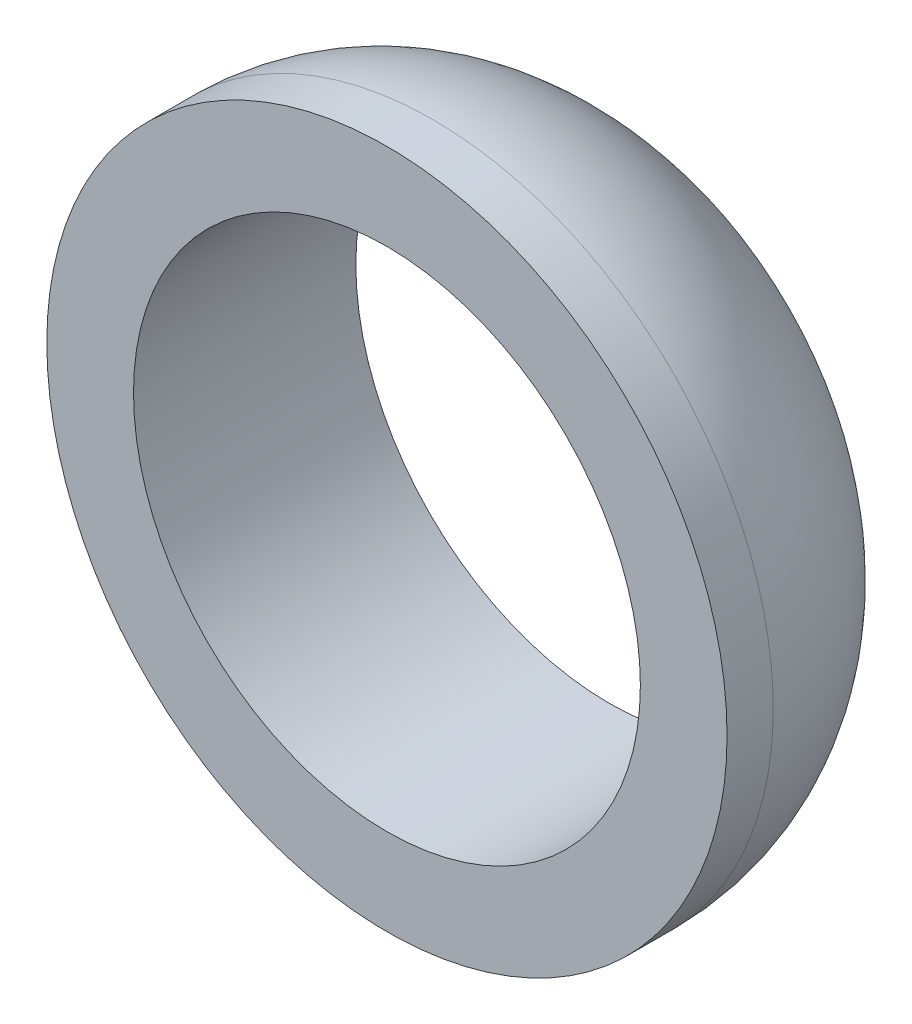
ISO-10303-21;
HEADER;
FILE_DESCRIPTION(('STEP AP214'),'2;1');
FILE_NAME('part.step','',(''),(''),'','','');
FILE_SCHEMA(('AUTOMOTIVE_DESIGN { 1 0 10303 214 1 1 1 1 }'));
ENDSEC;
DATA;
#1=APPLICATION_CONTEXT('core data for automotive mechanical design processes');
#2=APPLICATION_PROTOCOL_DEFINITION('international standard','automotive_design',2000,#1);
#3=PRODUCT_CONTEXT('',#1,'mechanical');
#4=PRODUCT('Part','Part','',(#3));
#5=PRODUCT_RELATED_PRODUCT_CATEGORY('part','',(#4));
#6=PRODUCT_DEFINITION_FORMATION('','',#4);
#7=PRODUCT_DEFINITION_CONTEXT('part definition',#1,'design');
#8=PRODUCT_DEFINITION('design','',#6,#7);
#9=PRODUCT_DEFINITION_SHAPE('','',#8);
#10=(LENGTH_UNIT() NAMED_UNIT(*) SI_UNIT(.MILLI.,.METRE.));
#11=(NAMED_UNIT(*) PLANE_ANGLE_UNIT() SI_UNIT($,.RADIAN.));
#12=(NAMED_UNIT(*) SI_UNIT($,.STERADIAN.) SOLID_ANGLE_UNIT());
#13=UNCERTAINTY_MEASURE_WITH_UNIT(LENGTH_MEASURE(1.E-05),#10,'distance_accuracy_value','');
#14=(GEOMETRIC_REPRESENTATION_CONTEXT(3) GLOBAL_UNCERTAINTY_ASSIGNED_CONTEXT((#13)) GLOBAL_UNIT_ASSIGNED_CONTEXT((#10,
#11,#12)) REPRESENTATION_CONTEXT('',''));
#15=CARTESIAN_POINT('',(0.,0.,0.));
#16=DIRECTION('',(0.,0.,1.));
#17=DIRECTION('',(1.,0.,0.));
#18=AXIS2_PLACEMENT_3D('',#15,#16,#17);
#19=CARTESIAN_POINT('',(-9.84106077625325,7.9927397167539,12.7));
#20=DIRECTION('',(0.,0.,-1.));
#21=DIRECTION('',(-1.,0.,0.));
#22=AXIS2_PLACEMENT_3D('',#19,#20,#21);
#23=CYLINDRICAL_SURFACE('',#22,19.431);
#24=CARTESIAN_POINT('',(-9.84106077625325,7.9927397167539,10.063497950514));
#25=DIRECTION('',(0.,0.,-1.));
#26=DIRECTION('',(-1.,0.,0.));
#27=AXIS2_PLACEMENT_3D('',#24,#25,#26);
#28=CIRCLE('',#27,19.431);
#29=CARTESIAN_POINT('',(-29.2720607762532,7.9927397167539,10.063497950514));
#30=VERTEX_POINT('',#29);
#31=EDGE_CURVE('E10',#30,#30,#28,.F.);
#32=ORIENTED_EDGE('',*,*,#31,.T.);
#33=EDGE_LOOP('',(#32));
#34=FACE_BOUND('',#33,.T.);
#35=CARTESIAN_POINT('',(-9.84106077625325,7.9927397167539,12.7));
#36=DIRECTION('',(0.,0.,1.));
#37=DIRECTION('',(1.,0.,0.));
#38=AXIS2_PLACEMENT_3D('',#35,#36,#37);
#39=CIRCLE('',#38,19.431);
#40=CARTESIAN_POINT('',(9.58993922374675,7.9927397167539,12.7));
#41=VERTEX_POINT('',#40);
#42=EDGE_CURVE('E43',#41,#41,#39,.T.);
#43=ORIENTED_EDGE('',*,*,#42,.F.);
#44=EDGE_LOOP('',(#43));
#45=FACE_BOUND('',#44,.T.);
#46=ADVANCED_FACE('F35',(#34,#45),#23,.T.);
#47=CARTESIAN_POINT('',(-9.84106077625325,7.9927397167539,12.7));
#48=DIRECTION('',(0.,0.,1.));
#49=DIRECTION('',(1.,0.,0.));
#50=AXIS2_PLACEMENT_3D('',#47,#48,#49);
#51=PLANE('',#50);
#52=CARTESIAN_POINT('',(-9.84106077625325,7.9927397167539,12.7));
#53=DIRECTION('',(0.,0.,-1.));
#54=DIRECTION('',(-1.,0.,0.));
#55=AXIS2_PLACEMENT_3D('',#52,#53,#54);
#56=CIRCLE('',#55,14.478);
#57=CARTESIAN_POINT('',(-24.3190607762532,7.9927397167539,12.7));
#58=VERTEX_POINT('',#57);
#59=EDGE_CURVE('E48',#58,#58,#56,.T.);
#60=ORIENTED_EDGE('',*,*,#59,.T.);
#61=EDGE_LOOP('',(#60));
#62=FACE_BOUND('',#61,.T.);
#63=ORIENTED_EDGE('',*,*,#42,.T.);
#64=EDGE_LOOP('',(#63));
#65=FACE_BOUND('',#64,.T.);
#66=ADVANCED_FACE('F67',(#62,#65),#51,.T.);
#67=CARTESIAN_POINT('',(-9.84106077625325,7.9927397167539,12.7));
#68=DIRECTION('',(0.,0.,-1.));
#69=DIRECTION('',(-1.,0.,0.));
#70=AXIS2_PLACEMENT_3D('',#67,#68,#69);
#71=CYLINDRICAL_SURFACE('',#70,14.478);
#72=ORIENTED_EDGE('',*,*,#59,.F.);
#73=EDGE_LOOP('',(#72));
#74=FACE_BOUND('',#73,.T.);
#75=CARTESIAN_POINT('',(-9.84106077625325,7.9927397167539,0.));
#76=DIRECTION('',(0.,0.,-1.));
#77=DIRECTION('',(-1.,0.,0.));
#78=AXIS2_PLACEMENT_3D('',#75,#76,#77);
#79=CIRCLE('',#78,14.478);
#80=CARTESIAN_POINT('',(-24.3190607762532,7.9927397167539,0.));
#81=VERTEX_POINT('',#80);
#82=EDGE_CURVE('E53',#81,#81,#79,.T.);
#83=ORIENTED_EDGE('',*,*,#82,.T.);
#84=EDGE_LOOP('',(#83));
#85=FACE_BOUND('',#84,.T.);
#86=ADVANCED_FACE('F60',(#74,#85),#71,.F.);
#87=CARTESIAN_POINT('',(-9.84106077625325,7.9927397167539,10.063497950514));
#88=DIRECTION('',(0.,0.,-1.));
#89=DIRECTION('',(-1.,0.,0.));
#90=AXIS2_PLACEMENT_3D('',#87,#88,#89);
#91=DEGENERATE_TOROIDAL_SURFACE('',#90,6.731,12.7,.T.);
#92=ORIENTED_EDGE('',*,*,#82,.F.);
#93=EDGE_LOOP('',(#92));
#94=FACE_BOUND('',#93,.T.);
#95=ORIENTED_EDGE('',*,*,#31,.F.);
#96=EDGE_LOOP('',(#95));
#97=FACE_BOUND('',#96,.T.);
#98=ADVANCED_FACE('F37',(#94,#97),#91,.T.);
#99=CLOSED_SHELL('',(#46,#66,#86,#98));
#100=MANIFOLD_SOLID_BREP('B2',#99);
#101=ADVANCED_BREP_SHAPE_REPRESENTATION('',(#18,#100),#14);
#102=SHAPE_DEFINITION_REPRESENTATION(#9,#101);
ENDSEC;
END-ISO-10303-21;
